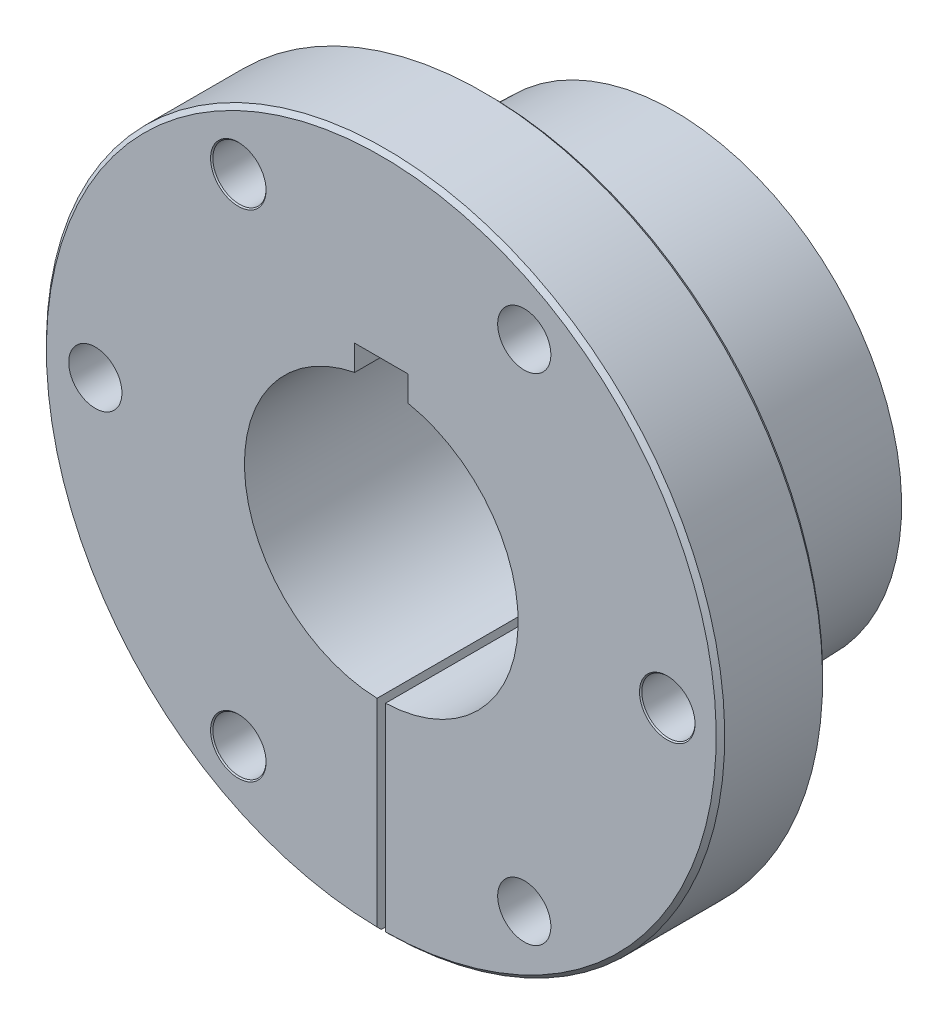
ISO-10303-21;
HEADER;
FILE_DESCRIPTION(('STEP AP214'),'2;1');
FILE_NAME('part.step','',(''),(''),'','','');
FILE_SCHEMA(('AUTOMOTIVE_DESIGN { 1 0 10303 214 1 1 1 1 }'));
ENDSEC;
DATA;
#1=APPLICATION_CONTEXT('core data for automotive mechanical design processes');
#2=APPLICATION_PROTOCOL_DEFINITION('international standard','automotive_design',2000,#1);
#3=PRODUCT_CONTEXT('',#1,'mechanical');
#4=PRODUCT('Part','Part','',(#3));
#5=PRODUCT_RELATED_PRODUCT_CATEGORY('part','',(#4));
#6=PRODUCT_DEFINITION_FORMATION('','',#4);
#7=PRODUCT_DEFINITION_CONTEXT('part definition',#1,'design');
#8=PRODUCT_DEFINITION('design','',#6,#7);
#9=PRODUCT_DEFINITION_SHAPE('','',#8);
#10=(LENGTH_UNIT() NAMED_UNIT(*) SI_UNIT(.MILLI.,.METRE.));
#11=(NAMED_UNIT(*) PLANE_ANGLE_UNIT() SI_UNIT($,.RADIAN.));
#12=(NAMED_UNIT(*) SI_UNIT($,.STERADIAN.) SOLID_ANGLE_UNIT());
#13=UNCERTAINTY_MEASURE_WITH_UNIT(LENGTH_MEASURE(1.E-05),#10,'distance_accuracy_value','');
#14=(GEOMETRIC_REPRESENTATION_CONTEXT(3) GLOBAL_UNCERTAINTY_ASSIGNED_CONTEXT((#13)) GLOBAL_UNIT_ASSIGNED_CONTEXT((#10,
#11,#12)) REPRESENTATION_CONTEXT('',''));
#15=CARTESIAN_POINT('',(0.,0.,0.));
#16=DIRECTION('',(0.,0.,1.));
#17=DIRECTION('',(1.,0.,0.));
#18=AXIS2_PLACEMENT_3D('',#15,#16,#17);
#19=CARTESIAN_POINT('',(-1.88408363451055E-13,26.98115,-12.7));
#20=DIRECTION('',(0.,0.,-1.));
#21=DIRECTION('',(-1.,0.,0.));
#22=AXIS2_PLACEMENT_3D('',#19,#20,#21);
#23=PLANE('',#22);
#24=CARTESIAN_POINT('',(-17.0656250000001,29.5585295629176,-12.7));
#25=DIRECTION('',(0.,0.,-1.));
#26=DIRECTION('',(-1.,0.,0.));
#27=AXIS2_PLACEMENT_3D('',#24,#25,#26);
#28=CIRCLE('',#27,3.31248153285078);
#29=CARTESIAN_POINT('',(-20.3781065328509,29.5585295629176,-12.7));
#30=VERTEX_POINT('',#29);
#31=EDGE_CURVE('E194',#30,#30,#28,.F.);
#32=ORIENTED_EDGE('',*,*,#31,.T.);
#33=EDGE_LOOP('',(#32));
#34=FACE_BOUND('',#33,.T.);
#35=CARTESIAN_POINT('',(17.0656249999997,29.5585295629178,-12.7));
#36=DIRECTION('',(0.,0.,-1.));
#37=DIRECTION('',(-1.,0.,0.));
#38=AXIS2_PLACEMENT_3D('',#35,#36,#37);
#39=CIRCLE('',#38,3.175);
#40=CARTESIAN_POINT('',(13.8906249999997,29.5585295629178,-12.7));
#41=VERTEX_POINT('',#40);
#42=EDGE_CURVE('E208',#41,#41,#39,.F.);
#43=ORIENTED_EDGE('',*,*,#42,.T.);
#44=EDGE_LOOP('',(#43));
#45=FACE_BOUND('',#44,.T.);
#46=CARTESIAN_POINT('',(17.0656250000001,-29.5585295629175,-12.7));
#47=DIRECTION('',(0.,0.,-1.));
#48=DIRECTION('',(-1.,0.,0.));
#49=AXIS2_PLACEMENT_3D('',#46,#47,#48);
#50=CIRCLE('',#49,3.175);
#51=CARTESIAN_POINT('',(13.8906250000001,-29.5585295629175,-12.7));
#52=VERTEX_POINT('',#51);
#53=EDGE_CURVE('E213',#52,#52,#50,.F.);
#54=ORIENTED_EDGE('',*,*,#53,.T.);
#55=EDGE_LOOP('',(#54));
#56=FACE_BOUND('',#55,.T.);
#57=DIRECTION('',(0.,1.,0.));
#58=VECTOR('',#57,1.);
#59=CARTESIAN_POINT('',(-0.508000000000005,26.98115,-12.7));
#60=LINE('',#59,#58);
#61=CARTESIAN_POINT('',(-0.508,-39.9700219109585,-12.7));
#62=VERTEX_POINT('',#61);
#63=CARTESIAN_POINT('',(-0.508000000000001,-26.9763672743848,-12.7));
#64=VERTEX_POINT('',#63);
#65=EDGE_CURVE('E311',#62,#64,#60,.T.);
#66=ORIENTED_EDGE('',*,*,#65,.F.);
#67=CARTESIAN_POINT('',(0.,0.,-12.7));
#68=DIRECTION('',(0.,0.,1.));
#69=DIRECTION('',(1.,0.,0.));
#70=AXIS2_PLACEMENT_3D('',#67,#68,#69);
#71=CIRCLE('',#70,39.97325);
#72=CARTESIAN_POINT('',(0.508,-39.9700219109585,-12.7));
#73=VERTEX_POINT('',#72);
#74=EDGE_CURVE('E369',#73,#62,#71,.T.);
#75=ORIENTED_EDGE('',*,*,#74,.F.);
#76=DIRECTION('',(0.,-1.,0.));
#77=VECTOR('',#76,1.);
#78=CARTESIAN_POINT('',(0.508000000000005,26.98115,-12.7));
#79=LINE('',#78,#77);
#80=CARTESIAN_POINT('',(0.508000000000001,-26.9763672743848,-12.7));
#81=VERTEX_POINT('',#80);
#82=EDGE_CURVE('E291',#81,#73,#79,.T.);
#83=ORIENTED_EDGE('',*,*,#82,.F.);
#84=CARTESIAN_POINT('',(0.,0.,-12.7));
#85=DIRECTION('',(0.,0.,1.));
#86=DIRECTION('',(1.,0.,0.));
#87=AXIS2_PLACEMENT_3D('',#84,#85,#86);
#88=CIRCLE('',#87,26.98115);
#89=EDGE_CURVE('E376',#81,#64,#88,.T.);
#90=ORIENTED_EDGE('',*,*,#89,.T.);
#91=EDGE_LOOP('',(#66,#75,#83,#90));
#92=FACE_BOUND('',#91,.T.);
#93=CARTESIAN_POINT('',(-34.13125,0.,-12.7));
#94=DIRECTION('',(0.,0.,-1.));
#95=DIRECTION('',(-1.,0.,0.));
#96=AXIS2_PLACEMENT_3D('',#93,#94,#95);
#97=CIRCLE('',#96,3.175);
#98=CARTESIAN_POINT('',(-37.30625,0.,-12.7));
#99=VERTEX_POINT('',#98);
#100=EDGE_CURVE('E234',#99,#99,#97,.F.);
#101=ORIENTED_EDGE('',*,*,#100,.T.);
#102=EDGE_LOOP('',(#101));
#103=FACE_BOUND('',#102,.T.);
#104=CARTESIAN_POINT('',(34.13125,0.,-12.7));
#105=DIRECTION('',(0.,0.,-1.));
#106=DIRECTION('',(-1.,0.,0.));
#107=AXIS2_PLACEMENT_3D('',#104,#105,#106);
#108=CIRCLE('',#107,3.31248153285078);
#109=CARTESIAN_POINT('',(30.8187684671492,0.,-12.7));
#110=VERTEX_POINT('',#109);
#111=EDGE_CURVE('E225',#110,#110,#108,.F.);
#112=ORIENTED_EDGE('',*,*,#111,.T.);
#113=EDGE_LOOP('',(#112));
#114=FACE_BOUND('',#113,.T.);
#115=CARTESIAN_POINT('',(-17.0656249999997,-29.5585295629178,-12.7));
#116=DIRECTION('',(0.,0.,-1.));
#117=DIRECTION('',(-1.,0.,0.));
#118=AXIS2_PLACEMENT_3D('',#115,#116,#117);
#119=CIRCLE('',#118,3.31248153285078);
#120=CARTESIAN_POINT('',(-20.3781065328505,-29.5585295629178,-12.7));
#121=VERTEX_POINT('',#120);
#122=EDGE_CURVE('E189',#121,#121,#119,.F.);
#123=ORIENTED_EDGE('',*,*,#122,.T.);
#124=EDGE_LOOP('',(#123));
#125=FACE_BOUND('',#124,.T.);
#126=ADVANCED_FACE('F40',(#34,#45,#56,#92,#103,#114,#125),#23,.T.);
#127=CARTESIAN_POINT('',(-17.0656249999997,-29.5585295629178,-34.926));
#128=DIRECTION('',(0.,0.,1.));
#129=DIRECTION('',(1.,0.,0.));
#130=AXIS2_PLACEMENT_3D('',#127,#128,#129);
#131=CYLINDRICAL_SURFACE('',#130,3.175);
#132=CARTESIAN_POINT('',(-17.0656249999997,-29.5585295629178,-0.137481532850775));
#133=DIRECTION('',(0.,0.,1.));
#134=DIRECTION('',(1.,0.,0.));
#135=AXIS2_PLACEMENT_3D('',#132,#133,#134);
#136=CIRCLE('',#135,3.175);
#137=CARTESIAN_POINT('',(-13.8906249999997,-29.5585295629178,-0.137481532850775));
#138=VERTEX_POINT('',#137);
#139=EDGE_CURVE('E198',#138,#138,#136,.T.);
#140=ORIENTED_EDGE('',*,*,#139,.T.);
#141=EDGE_LOOP('',(#140));
#142=FACE_BOUND('',#141,.T.);
#143=CARTESIAN_POINT('',(-17.0656249999997,-29.5585295629178,-12.5625184671492));
#144=DIRECTION('',(0.,0.,-1.));
#145=DIRECTION('',(-1.,0.,0.));
#146=AXIS2_PLACEMENT_3D('',#143,#144,#145);
#147=CIRCLE('',#146,3.175);
#148=CARTESIAN_POINT('',(-20.2406249999997,-29.5585295629178,-12.5625184671492));
#149=VERTEX_POINT('',#148);
#150=EDGE_CURVE('E184',#149,#149,#147,.F.);
#151=ORIENTED_EDGE('',*,*,#150,.F.);
#152=EDGE_LOOP('',(#151));
#153=FACE_BOUND('',#152,.T.);
#154=ADVANCED_FACE('F413',(#142,#153),#131,.F.);
#155=CARTESIAN_POINT('',(-17.0656250000001,29.5585295629176,-34.926));
#156=DIRECTION('',(0.,0.,1.));
#157=DIRECTION('',(1.,0.,0.));
#158=AXIS2_PLACEMENT_3D('',#155,#156,#157);
#159=CYLINDRICAL_SURFACE('',#158,3.175);
#160=CARTESIAN_POINT('',(-17.0656250000001,29.5585295629176,-0.137481532850775));
#161=DIRECTION('',(0.,0.,1.));
#162=DIRECTION('',(1.,0.,0.));
#163=AXIS2_PLACEMENT_3D('',#160,#161,#162);
#164=CIRCLE('',#163,3.175);
#165=CARTESIAN_POINT('',(-13.8906250000001,29.5585295629176,-0.137481532850775));
#166=VERTEX_POINT('',#165);
#167=EDGE_CURVE('E203',#166,#166,#164,.T.);
#168=ORIENTED_EDGE('',*,*,#167,.T.);
#169=EDGE_LOOP('',(#168));
#170=FACE_BOUND('',#169,.T.);
#171=CARTESIAN_POINT('',(-17.0656250000001,29.5585295629176,-12.5625184671492));
#172=DIRECTION('',(0.,0.,-1.));
#173=DIRECTION('',(-1.,0.,0.));
#174=AXIS2_PLACEMENT_3D('',#171,#172,#173);
#175=CIRCLE('',#174,3.175);
#176=CARTESIAN_POINT('',(-20.2406250000001,29.5585295629176,-12.5625184671492));
#177=VERTEX_POINT('',#176);
#178=EDGE_CURVE('E193',#177,#177,#175,.F.);
#179=ORIENTED_EDGE('',*,*,#178,.F.);
#180=EDGE_LOOP('',(#179));
#181=FACE_BOUND('',#180,.T.);
#182=ADVANCED_FACE('F415',(#170,#181),#159,.F.);
#183=CARTESIAN_POINT('',(34.13125,0.,-34.926));
#184=DIRECTION('',(0.,0.,1.));
#185=DIRECTION('',(1.,0.,0.));
#186=AXIS2_PLACEMENT_3D('',#183,#184,#185);
#187=CYLINDRICAL_SURFACE('',#186,3.175);
#188=CARTESIAN_POINT('',(34.13125,0.,-0.137481532850775));
#189=DIRECTION('',(0.,0.,1.));
#190=DIRECTION('',(1.,0.,0.));
#191=AXIS2_PLACEMENT_3D('',#188,#189,#190);
#192=CIRCLE('',#191,3.175);
#193=CARTESIAN_POINT('',(37.30625,0.,-0.137481532850775));
#194=VERTEX_POINT('',#193);
#195=EDGE_CURVE('E229',#194,#194,#192,.T.);
#196=ORIENTED_EDGE('',*,*,#195,.T.);
#197=EDGE_LOOP('',(#196));
#198=FACE_BOUND('',#197,.T.);
#199=CARTESIAN_POINT('',(34.13125,0.,-12.5625184671492));
#200=DIRECTION('',(0.,0.,-1.));
#201=DIRECTION('',(-1.,0.,0.));
#202=AXIS2_PLACEMENT_3D('',#199,#200,#201);
#203=CIRCLE('',#202,3.175);
#204=CARTESIAN_POINT('',(30.95625,0.,-12.5625184671492));
#205=VERTEX_POINT('',#204);
#206=EDGE_CURVE('E221',#205,#205,#203,.F.);
#207=ORIENTED_EDGE('',*,*,#206,.F.);
#208=EDGE_LOOP('',(#207));
#209=FACE_BOUND('',#208,.T.);
#210=ADVANCED_FACE('F277',(#198,#209),#187,.F.);
#211=CARTESIAN_POINT('',(-1.10854532508269E-13,15.875,-34.925));
#212=DIRECTION('',(0.,0.,-1.));
#213=DIRECTION('',(-1.,0.,0.));
#214=AXIS2_PLACEMENT_3D('',#211,#212,#213);
#215=PLANE('',#214);
#216=CARTESIAN_POINT('',(0.,0.,-34.925));
#217=DIRECTION('',(0.,0.,1.));
#218=DIRECTION('',(1.,0.,0.));
#219=AXIS2_PLACEMENT_3D('',#216,#217,#218);
#220=CIRCLE('',#219,16.3351492643292);
#221=CARTESIAN_POINT('',(0.508000000000002,-16.327248313415,-34.925));
#222=VERTEX_POINT('',#221);
#223=CARTESIAN_POINT('',(3.175,16.0236224521147,-34.925));
#224=VERTEX_POINT('',#223);
#225=EDGE_CURVE('E160',#222,#224,#220,.T.);
#226=ORIENTED_EDGE('',*,*,#225,.T.);
#227=DIRECTION('',(0.,1.,0.));
#228=VECTOR('',#227,1.);
#229=CARTESIAN_POINT('',(3.175,19.05,-34.925));
#230=LINE('',#229,#228);
#231=CARTESIAN_POINT('',(3.175,19.05,-34.925));
#232=VERTEX_POINT('',#231);
#233=EDGE_CURVE('E489',#224,#232,#230,.T.);
#234=ORIENTED_EDGE('',*,*,#233,.T.);
#235=DIRECTION('',(-1.,0.,0.));
#236=VECTOR('',#235,1.);
#237=CARTESIAN_POINT('',(-3.175,19.05,-34.925));
#238=LINE('',#237,#236);
#239=CARTESIAN_POINT('',(-3.175,19.05,-34.925));
#240=VERTEX_POINT('',#239);
#241=EDGE_CURVE('E176',#232,#240,#238,.T.);
#242=ORIENTED_EDGE('',*,*,#241,.T.);
#243=DIRECTION('',(0.,-1.,0.));
#244=VECTOR('',#243,1.);
#245=CARTESIAN_POINT('',(-3.175,19.05,-34.925));
#246=LINE('',#245,#244);
#247=CARTESIAN_POINT('',(-3.175,16.0236224521147,-34.925));
#248=VERTEX_POINT('',#247);
#249=EDGE_CURVE('E181',#240,#248,#246,.T.);
#250=ORIENTED_EDGE('',*,*,#249,.T.);
#251=CARTESIAN_POINT('',(-0.508000000000002,-16.327248313415,-34.925));
#252=VERTEX_POINT('',#251);
#253=EDGE_CURVE('E56',#248,#252,#220,.T.);
#254=ORIENTED_EDGE('',*,*,#253,.T.);
#255=DIRECTION('',(0.,-1.,0.));
#256=VECTOR('',#255,1.);
#257=CARTESIAN_POINT('',(-0.508000000000003,0.,-34.925));
#258=LINE('',#257,#256);
#259=CARTESIAN_POINT('',(-0.508000000000001,-27.1748396990701,-34.925));
#260=VERTEX_POINT('',#259);
#261=EDGE_CURVE('E242',#252,#260,#258,.T.);
#262=ORIENTED_EDGE('',*,*,#261,.T.);
#263=CARTESIAN_POINT('',(0.,0.,-34.925));
#264=DIRECTION('',(0.,0.,1.));
#265=DIRECTION('',(1.,0.,0.));
#266=AXIS2_PLACEMENT_3D('',#263,#264,#265);
#267=CIRCLE('',#266,27.1795875);
#268=CARTESIAN_POINT('',(0.508000000000001,-27.1748396990701,-34.925));
#269=VERTEX_POINT('',#268);
#270=EDGE_CURVE('E49',#269,#260,#267,.T.);
#271=ORIENTED_EDGE('',*,*,#270,.F.);
#272=DIRECTION('',(0.,1.,0.));
#273=VECTOR('',#272,1.);
#274=CARTESIAN_POINT('',(0.508000000000003,0.,-34.925));
#275=LINE('',#274,#273);
#276=EDGE_CURVE('E245',#269,#222,#275,.T.);
#277=ORIENTED_EDGE('',*,*,#276,.T.);
#278=EDGE_LOOP('',(#226,#234,#242,#250,#254,#262,#271,#277));
#279=FACE_BOUND('',#278,.T.);
#280=ADVANCED_FACE('F42',(#279),#215,.T.);
#281=CARTESIAN_POINT('',(0.,0.,-15.875));
#282=DIRECTION('',(0.,0.,1.));
#283=DIRECTION('',(1.,0.,0.));
#284=AXIS2_PLACEMENT_3D('',#281,#282,#283);
#285=CONICAL_SURFACE('',#284,27.7749,0.0312398334302683);
#286=CARTESIAN_POINT('',(-0.508000000000001,-28.9763204654552,22.7129404383794));
#287=CARTESIAN_POINT('',(-0.508000000000001,-28.4244679559789,5.05635214122596));
#288=CARTESIAN_POINT('',(-0.508000000000001,-27.8726096518357,-12.6002359748127));
#289=CARTESIAN_POINT('',(-0.508000000000001,-26.7688814542159,-47.9134118446609));
#290=CARTESIAN_POINT('',(-0.508000000000001,-26.2170115607392,-65.5699995984703));
#291=CARTESIAN_POINT('',(-0.508000000000001,-25.6651358725957,-83.226587171165));
#292=B_SPLINE_CURVE_WITH_KNOTS('',3,(#286,#287,#288,#289,#290,#291),.UNSPECIFIED.,.F.,.F.,(4,2,
4),(0.,52.9956306065473,105.991261213095),.UNSPECIFIED.);
#293=CARTESIAN_POINT('',(-0.508000000000001,-27.7702539781328,-15.875));
#294=VERTEX_POINT('',#293);
#295=EDGE_CURVE('E322',#294,#260,#292,.T.);
#296=ORIENTED_EDGE('',*,*,#295,.F.);
#297=CARTESIAN_POINT('',(0.,0.,-15.875));
#298=DIRECTION('',(0.,0.,1.));
#299=DIRECTION('',(1.,0.,0.));
#300=AXIS2_PLACEMENT_3D('',#297,#298,#299);
#301=CIRCLE('',#300,27.7749);
#302=CARTESIAN_POINT('',(0.508000000000001,-27.7702539781328,-15.875));
#303=VERTEX_POINT('',#302);
#304=EDGE_CURVE('E386',#303,#294,#301,.T.);
#305=ORIENTED_EDGE('',*,*,#304,.F.);
#306=CARTESIAN_POINT('',(0.508000000000001,-25.6651358725957,-83.226587171165));
#307=CARTESIAN_POINT('',(0.508000000000001,-26.2170115607392,-65.5699995984703));
#308=CARTESIAN_POINT('',(0.508000000000001,-26.7688814542159,-47.9134118446609));
#309=CARTESIAN_POINT('',(0.508000000000001,-27.8726096518357,-12.6002359748127));
#310=CARTESIAN_POINT('',(0.508000000000001,-28.4244679559789,5.05635214122596));
#311=CARTESIAN_POINT('',(0.508000000000001,-28.9763204654552,22.7129404383794));
#312=B_SPLINE_CURVE_WITH_KNOTS('',3,(#306,#307,#308,#309,#310,#311),.UNSPECIFIED.,.F.,.F.,(4,2,
4),(0.,52.995630606548,105.991261213095),.UNSPECIFIED.);
#313=EDGE_CURVE('E339',#269,#303,#312,.T.);
#314=ORIENTED_EDGE('',*,*,#313,.F.);
#315=ORIENTED_EDGE('',*,*,#270,.T.);
#316=EDGE_LOOP('',(#296,#305,#314,#315));
#317=FACE_BOUND('',#316,.T.);
#318=ADVANCED_FACE('F332',(#317),#285,.T.);
#319=CARTESIAN_POINT('',(-1.93951090076468E-13,27.7749,-15.875));
#320=DIRECTION('',(0.,0.,1.));
#321=DIRECTION('',(1.,0.,0.));
#322=AXIS2_PLACEMENT_3D('',#319,#320,#321);
#323=PLANE('',#322);
#324=DIRECTION('',(0.,-1.,0.));
#325=VECTOR('',#324,1.);
#326=CARTESIAN_POINT('',(-0.508000000000005,27.7749,-15.875));
#327=LINE('',#326,#325);
#328=CARTESIAN_POINT('',(-0.508000000000001,-26.9763672743848,-15.875));
#329=VERTEX_POINT('',#328);
#330=EDGE_CURVE('E319',#329,#294,#327,.T.);
#331=ORIENTED_EDGE('',*,*,#330,.F.);
#332=CARTESIAN_POINT('',(0.,0.,-15.875));
#333=DIRECTION('',(0.,0.,1.));
#334=DIRECTION('',(1.,0.,0.));
#335=AXIS2_PLACEMENT_3D('',#332,#333,#334);
#336=CIRCLE('',#335,26.98115);
#337=CARTESIAN_POINT('',(0.508000000000001,-26.9763672743848,-15.875));
#338=VERTEX_POINT('',#337);
#339=EDGE_CURVE('E382',#338,#329,#336,.T.);
#340=ORIENTED_EDGE('',*,*,#339,.F.);
#341=DIRECTION('',(0.,1.,0.));
#342=VECTOR('',#341,1.);
#343=CARTESIAN_POINT('',(0.508000000000005,27.7749,-15.875));
#344=LINE('',#343,#342);
#345=EDGE_CURVE('E347',#303,#338,#344,.T.);
#346=ORIENTED_EDGE('',*,*,#345,.F.);
#347=ORIENTED_EDGE('',*,*,#304,.T.);
#348=EDGE_LOOP('',(#331,#340,#346,#347));
#349=FACE_BOUND('',#348,.T.);
#350=ADVANCED_FACE('F336',(#349),#323,.T.);
#351=CARTESIAN_POINT('',(0.,0.,0.));
#352=DIRECTION('',(0.,0.,1.));
#353=DIRECTION('',(1.,0.,0.));
#354=AXIS2_PLACEMENT_3D('',#351,#352,#353);
#355=CYLINDRICAL_SURFACE('',#354,26.98115);
#356=DIRECTION('',(0.,0.,1.));
#357=VECTOR('',#356,1.);
#358=CARTESIAN_POINT('',(-0.508000000000001,-26.9763672743848,0.));
#359=LINE('',#358,#357);
#360=EDGE_CURVE('E316',#64,#329,#359,.F.);
#361=ORIENTED_EDGE('',*,*,#360,.F.);
#362=ORIENTED_EDGE('',*,*,#89,.F.);
#363=DIRECTION('',(0.,0.,1.));
#364=VECTOR('',#363,1.);
#365=CARTESIAN_POINT('',(0.508000000000001,-26.9763672743848,0.));
#366=LINE('',#365,#364);
#367=EDGE_CURVE('E468',#338,#81,#366,.T.);
#368=ORIENTED_EDGE('',*,*,#367,.F.);
#369=ORIENTED_EDGE('',*,*,#339,.T.);
#370=EDGE_LOOP('',(#361,#362,#368,#369));
#371=FACE_BOUND('',#370,.T.);
#372=ADVANCED_FACE('F298',(#371),#355,.T.);
#373=CARTESIAN_POINT('',(0.,0.,-12.192));
#374=DIRECTION('',(0.,0.,1.));
#375=DIRECTION('',(1.,0.,0.));
#376=AXIS2_PLACEMENT_3D('',#373,#374,#375);
#377=CONICAL_SURFACE('',#376,40.48125,0.785398163397457);
#378=CARTESIAN_POINT('',(-0.507999999999998,-69.1589964893393,16.4876121939633));
#379=CARTESIAN_POINT('',(-0.507999999999998,-66.5476374563169,13.8763243733235));
#380=CARTESIAN_POINT('',(-0.507999999999998,-63.9362751585272,11.2650398175094));
#381=CARTESIAN_POINT('',(-0.507999999999999,-58.713538942019,6.0424823542008));
#382=CARTESIAN_POINT('',(-0.507999999999999,-56.1021650233004,3.43120944670634));
#383=CARTESIAN_POINT('',(-0.507999999999999,-50.8794004839596,-1.79131959087549));
#384=CARTESIAN_POINT('',(-0.507999999999999,-48.2680098633376,-4.40257572096311));
#385=CARTESIAN_POINT('',(-0.508,-43.0452014626395,-9.62506084621428));
#386=CARTESIAN_POINT('',(-0.508,-40.4337836825632,-12.2362898413777));
#387=CARTESIAN_POINT('',(-0.508,-35.210901936381,-17.4587017903888));
#388=CARTESIAN_POINT('',(-0.508000000000001,-32.5994379702737,-20.0698847442351));
#389=CARTESIAN_POINT('',(-0.508000000000001,-28.6821714033987,-23.9865885049184));
#390=CARTESIAN_POINT('',(-0.508000000000001,-27.3764041221107,-25.2921446361781));
#391=CARTESIAN_POINT('',(-0.508000000000001,-24.7648330886872,-27.9032204397117));
#392=CARTESIAN_POINT('',(-0.508000000000001,-23.4590293365515,-29.2087401119853));
#393=CARTESIAN_POINT('',(-0.508000000000002,-20.8473626358335,-31.819720382612));
#394=CARTESIAN_POINT('',(-0.508000000000002,-19.5414996872482,-33.1251809809618));
#395=CARTESIAN_POINT('',(-0.508000000000002,-16.9296710533228,-35.7359993522473));
#396=CARTESIAN_POINT('',(-0.508000000000002,-15.6237053679849,-37.0413571251851));
#397=CARTESIAN_POINT('',(-0.508000000000002,-13.664596442021,-38.9992334067168));
#398=CARTESIAN_POINT('',(-0.508000000000002,-13.0115333720803,-39.6518321325144));
#399=CARTESIAN_POINT('',(-0.508000000000002,-11.7053197190082,-40.9569419670216));
#400=CARTESIAN_POINT('',(-0.508000000000002,-11.0521691358785,-41.609453075733));
#401=CARTESIAN_POINT('',(-0.508000000000002,-9.74573445737477,-42.9143417716375));
#402=CARTESIAN_POINT('',(-0.508000000000002,-9.09245036198895,-43.566719358819));
#403=CARTESIAN_POINT('',(-0.508000000000002,-7.7855930878027,-44.8711849959762));
#404=CARTESIAN_POINT('',(-0.508000000000002,-7.13201990898033,-45.52327304593));
#405=CARTESIAN_POINT('',(-0.508000000000003,-6.47822442383138,-46.1751382984722));
#406=B_SPLINE_CURVE_WITH_KNOTS('',3,(#378,#379,#380,#381,#382,#383,#384,#385,#386,#387,#388,
#389,#390,#391,#392,#393,#394,#395,#396,#397,#398,#399,#400,#401,#402,#403,#404,#405),
.UNSPECIFIED.,.F.,.F.,(4,2,2,2,2,2,2,2,2,2,2,2,2,4),(0.,11.0789070189571,22.1578139806704,
33.2367207836906,44.3156276423277,55.3945348153457,60.9339883117279,66.4734418470067,
72.0128956744212,77.552349387445,80.3220764839178,83.0918035246127,85.8615308081327,
88.6312583020137),.UNSPECIFIED.);
#407=CARTESIAN_POINT('',(-0.508,-40.4780624235215,-12.192));
#408=VERTEX_POINT('',#407);
#409=EDGE_CURVE('E303',#408,#62,#406,.T.);
#410=ORIENTED_EDGE('',*,*,#409,.F.);
#411=CARTESIAN_POINT('',(0.,0.,-12.192));
#412=DIRECTION('',(0.,0.,1.));
#413=DIRECTION('',(1.,0.,0.));
#414=AXIS2_PLACEMENT_3D('',#411,#412,#413);
#415=CIRCLE('',#414,40.48125);
#416=CARTESIAN_POINT('',(0.508,-40.4780624235215,-12.192));
#417=VERTEX_POINT('',#416);
#418=EDGE_CURVE('E367',#417,#408,#415,.T.);
#419=ORIENTED_EDGE('',*,*,#418,.F.);
#420=CARTESIAN_POINT('',(0.508000000000003,-6.47822442383138,-46.1751382984722));
#421=CARTESIAN_POINT('',(0.508000000000003,-6.92750194215529,-45.7272144717513));
#422=CARTESIAN_POINT('',(0.508000000000002,-7.376660190333,-45.2791710794303));
#423=CARTESIAN_POINT('',(0.508000000000002,-8.27480988366716,-44.3829171854311));
#424=CARTESIAN_POINT('',(0.508000000000002,-8.7238013288339,-43.9347066837631));
#425=CARTESIAN_POINT('',(0.508000000000002,-10.0706330824567,-42.5899325308355));
#426=CARTESIAN_POINT('',(0.508000000000002,-10.9683308754569,-41.6932261653886));
#427=CARTESIAN_POINT('',(0.508000000000002,-13.661172498799,-39.0028559196428));
#428=CARTESIAN_POINT('',(0.508000000000002,-15.4560649764089,-37.2089404876826));
#429=CARTESIAN_POINT('',(0.508000000000002,-19.0456393306199,-33.6208989541218));
#430=CARTESIAN_POINT('',(0.508000000000001,-20.8403212072201,-31.8267728525203));
#431=CARTESIAN_POINT('',(0.508000000000001,-26.2242176328872,-26.4442447086495));
#432=CARTESIAN_POINT('',(0.508000000000001,-29.8132826809762,-22.8556931240166));
#433=CARTESIAN_POINT('',(0.508,-34.1389756962338,-18.5304960133028));
#434=CARTESIAN_POINT('',(0.508,-34.8756525229658,-17.7938993427032));
#435=CARTESIAN_POINT('',(0.508,-36.3490010821156,-16.3207009412015));
#436=CARTESIAN_POINT('',(0.508,-37.0856728145334,-15.5840992102995));
#437=CARTESIAN_POINT('',(0.508,-43.0452254662174,-9.62508534711366));
#438=CARTESIAN_POINT('',(0.508,-48.2680226121946,-4.40258943486921));
#439=CARTESIAN_POINT('',(0.507999999999998,-58.7135419950761,6.04247839075119));
#440=CARTESIAN_POINT('',(0.507999999999998,-63.9362642319725,11.265050304135));
#441=CARTESIAN_POINT('',(0.507999999999998,-69.1589964893393,16.4876121939633));
#442=B_SPLINE_CURVE_WITH_KNOTS('',3,(#420,#421,#422,#423,#424,#425,#426,#427,#428,#429,#430,
#431,#432,#433,#434,#435,#436,#437,#438,#439,#440,#441),.UNSPECIFIED.,.F.,.F.,(4,2,2,2,2,2,2,2,
2,2,4),(0.,1.90325354440624,3.80650697137256,7.61301354383694,15.2260249807147,22.8390364484862,
38.0650606431331,41.1903456896331,44.3156306624196,66.4734433290347,88.6312583043606),.UNSPECIFIED.);
#443=EDGE_CURVE('E283',#73,#417,#442,.T.);
#444=ORIENTED_EDGE('',*,*,#443,.F.);
#445=ORIENTED_EDGE('',*,*,#74,.T.);
#446=EDGE_LOOP('',(#410,#419,#444,#445));
#447=FACE_BOUND('',#446,.T.);
#448=ADVANCED_FACE('F293',(#447),#377,.T.);
#449=CARTESIAN_POINT('',(0.,0.,0.));
#450=DIRECTION('',(0.,0.,1.));
#451=DIRECTION('',(1.,0.,0.));
#452=AXIS2_PLACEMENT_3D('',#449,#450,#451);
#453=CYLINDRICAL_SURFACE('',#452,40.48125);
#454=DIRECTION('',(0.,0.,1.));
#455=VECTOR('',#454,1.);
#456=CARTESIAN_POINT('',(-0.508,-40.4780624235215,0.));
#457=LINE('',#456,#455);
#458=CARTESIAN_POINT('',(-0.508,-40.4780624235215,-0.508000000000009));
#459=VERTEX_POINT('',#458);
#460=EDGE_CURVE('E312',#459,#408,#457,.F.);
#461=ORIENTED_EDGE('',*,*,#460,.F.);
#462=CARTESIAN_POINT('',(0.,0.,-0.508000000000009));
#463=DIRECTION('',(0.,0.,1.));
#464=DIRECTION('',(1.,0.,0.));
#465=AXIS2_PLACEMENT_3D('',#462,#463,#464);
#466=CIRCLE('',#465,40.48125);
#467=CARTESIAN_POINT('',(0.508,-40.4780624235215,-0.508000000000009));
#468=VERTEX_POINT('',#467);
#469=EDGE_CURVE('E372',#468,#459,#466,.T.);
#470=ORIENTED_EDGE('',*,*,#469,.F.);
#471=DIRECTION('',(0.,0.,1.));
#472=VECTOR('',#471,1.);
#473=CARTESIAN_POINT('',(0.508,-40.4780624235215,0.));
#474=LINE('',#473,#472);
#475=EDGE_CURVE('E264',#417,#468,#474,.T.);
#476=ORIENTED_EDGE('',*,*,#475,.F.);
#477=ORIENTED_EDGE('',*,*,#418,.T.);
#478=EDGE_LOOP('',(#461,#470,#476,#477));
#479=FACE_BOUND('',#478,.T.);
#480=ADVANCED_FACE('F297',(#479),#453,.T.);
#481=CARTESIAN_POINT('',(0.,0.,0.));
#482=DIRECTION('',(0.,0.,-1.));
#483=DIRECTION('',(-1.,0.,0.));
#484=AXIS2_PLACEMENT_3D('',#481,#482,#483);
#485=CONICAL_SURFACE('',#484,39.97325,0.785398163397443);
#486=CARTESIAN_POINT('',(-0.508000000000003,-6.47822442383165,33.4751382984728));
#487=CARTESIAN_POINT('',(-0.508000000000003,-6.92750194215557,33.027214471752));
#488=CARTESIAN_POINT('',(-0.508000000000002,-7.37666019033329,32.579171079431));
#489=CARTESIAN_POINT('',(-0.508000000000002,-8.27480988366748,31.6829171854316));
#490=CARTESIAN_POINT('',(-0.508000000000002,-8.72380132883424,31.2347066837636));
#491=CARTESIAN_POINT('',(-0.508000000000002,-10.0706330824571,29.889932530836));
#492=CARTESIAN_POINT('',(-0.508000000000002,-10.9683308754574,28.993226165389));
#493=CARTESIAN_POINT('',(-0.508000000000002,-13.6611724987995,26.302855919643));
#494=CARTESIAN_POINT('',(-0.508000000000002,-15.4560649764095,24.5089404876827));
#495=CARTESIAN_POINT('',(-0.508000000000002,-19.0456393306206,20.9208989541217));
#496=CARTESIAN_POINT('',(-0.508000000000001,-20.8403212072209,19.1267728525201));
#497=CARTESIAN_POINT('',(-0.508000000000001,-26.2242176328881,13.744244708649));
#498=CARTESIAN_POINT('',(-0.508000000000001,-29.8132826809772,10.1556931240158));
#499=CARTESIAN_POINT('',(-0.508,-34.1389756962348,5.83049601330196));
#500=CARTESIAN_POINT('',(-0.508,-34.8756525229666,5.09389934270255));
#501=CARTESIAN_POINT('',(-0.508,-36.349001082116,3.62070094120116));
#502=CARTESIAN_POINT('',(-0.508,-37.0856728145336,2.8840992102993));
#503=CARTESIAN_POINT('',(-0.508,-43.0452254662174,-3.07491465288646));
#504=CARTESIAN_POINT('',(-0.508,-48.2680226121946,-8.29741056513103));
#505=CARTESIAN_POINT('',(-0.507999999999998,-58.713541995076,-18.7424783907516));
#506=CARTESIAN_POINT('',(-0.507999999999998,-63.9362642319724,-23.9650503041356));
#507=CARTESIAN_POINT('',(-0.507999999999998,-69.1589964893392,-29.187612193964));
#508=B_SPLINE_CURVE_WITH_KNOTS('',3,(#486,#487,#488,#489,#490,#491,#492,#493,#494,#495,#496,
#497,#498,#499,#500,#501,#502,#503,#504,#505,#506,#507),.UNSPECIFIED.,.F.,.F.,(4,2,2,2,2,2,2,2,
2,2,4),(0.,1.90325354440633,3.80650697137274,7.6130135438373,15.2260249807154,22.8390364484873,
38.0650606431349,41.1903456896342,44.3156306624199,66.4734433290352,88.6312583043613),.UNSPECIFIED.);
#509=CARTESIAN_POINT('',(-0.508,-39.9700219109585,0.));
#510=VERTEX_POINT('',#509);
#511=EDGE_CURVE('E346',#510,#459,#508,.T.);
#512=ORIENTED_EDGE('',*,*,#511,.F.);
#513=CARTESIAN_POINT('',(0.,0.,0.));
#514=DIRECTION('',(0.,0.,1.));
#515=DIRECTION('',(1.,0.,0.));
#516=AXIS2_PLACEMENT_3D('',#513,#514,#515);
#517=CIRCLE('',#516,39.97325);
#518=CARTESIAN_POINT('',(0.508,-39.9700219109585,0.));
#519=VERTEX_POINT('',#518);
#520=EDGE_CURVE('E330',#519,#510,#517,.T.);
#521=ORIENTED_EDGE('',*,*,#520,.F.);
#522=CARTESIAN_POINT('',(0.507999999999998,-69.1589964893392,-29.187612193964));
#523=CARTESIAN_POINT('',(0.507999999999998,-66.5476374563168,-26.5763243733242));
#524=CARTESIAN_POINT('',(0.507999999999998,-63.9362751585272,-23.9650398175099));
#525=CARTESIAN_POINT('',(0.507999999999999,-58.7135389420189,-18.7424823542013));
#526=CARTESIAN_POINT('',(0.507999999999999,-56.1021650233004,-16.1312094467068));
#527=CARTESIAN_POINT('',(0.507999999999999,-50.8794004839596,-10.9086804091248));
#528=CARTESIAN_POINT('',(0.507999999999999,-48.2680098633376,-8.29742427903713));
#529=CARTESIAN_POINT('',(0.508,-43.0452014626395,-3.07493915378584));
#530=CARTESIAN_POINT('',(0.508,-40.4337836825632,-0.463710158622371));
#531=CARTESIAN_POINT('',(0.508,-35.210901936381,4.75870179038883));
#532=CARTESIAN_POINT('',(0.508000000000001,-32.5994379702738,7.36988474423525));
#533=CARTESIAN_POINT('',(0.508000000000001,-28.6821714033988,11.2865885049186));
#534=CARTESIAN_POINT('',(0.508000000000001,-27.3764041221109,12.5921446361783));
#535=CARTESIAN_POINT('',(0.508000000000001,-24.7648330886874,15.2032204397119));
#536=CARTESIAN_POINT('',(0.508000000000001,-23.4590293365516,16.5087401119856));
#537=CARTESIAN_POINT('',(0.508000000000002,-20.8473626358337,19.1197203826123));
#538=CARTESIAN_POINT('',(0.508000000000002,-19.5414996872484,20.4251809809622));
#539=CARTESIAN_POINT('',(0.508000000000002,-16.929671053323,23.0359993522477));
#540=CARTESIAN_POINT('',(0.508000000000002,-15.6237053679851,24.3413571251855));
#541=CARTESIAN_POINT('',(0.508000000000002,-13.6645964420212,26.2992334067173));
#542=CARTESIAN_POINT('',(0.508000000000002,-13.0115333720805,26.9518321325149));
#543=CARTESIAN_POINT('',(0.508000000000002,-11.7053197190084,28.2569419670221));
#544=CARTESIAN_POINT('',(0.508000000000002,-11.0521691358788,28.9094530757335));
#545=CARTESIAN_POINT('',(0.508000000000002,-9.74573445737503,30.2143417716381));
#546=CARTESIAN_POINT('',(0.508000000000002,-9.09245036198921,30.8667193588196));
#547=CARTESIAN_POINT('',(0.508000000000002,-7.78559308780297,32.1711849959769));
#548=CARTESIAN_POINT('',(0.508000000000002,-7.13201990898059,32.8232730459306));
#549=CARTESIAN_POINT('',(0.508000000000003,-6.47822442383165,33.4751382984728));
#550=B_SPLINE_CURVE_WITH_KNOTS('',3,(#522,#523,#524,#525,#526,#527,#528,#529,#530,#531,#532,
#533,#534,#535,#536,#537,#538,#539,#540,#541,#542,#543,#544,#545,#546,#547,#548,#549),
.UNSPECIFIED.,.F.,.F.,(4,2,2,2,2,2,2,2,2,2,2,2,2,4),(0.,11.0789070189571,22.1578139806705,
33.2367207836908,44.315627642328,55.3945348153462,60.9339883117284,66.4734418470072,
72.0128956744218,77.5523493874456,80.3220764839185,83.0918035246133,85.8615308081334,
88.6312583020145),.UNSPECIFIED.);
#551=EDGE_CURVE('E250',#468,#519,#550,.T.);
#552=ORIENTED_EDGE('',*,*,#551,.F.);
#553=ORIENTED_EDGE('',*,*,#469,.T.);
#554=EDGE_LOOP('',(#512,#521,#552,#553));
#555=FACE_BOUND('',#554,.T.);
#556=ADVANCED_FACE('F266',(#555),#485,.T.);
#557=CARTESIAN_POINT('',(-1.1085453250827E-13,15.875,0.));
#558=DIRECTION('',(0.,0.,1.));
#559=DIRECTION('',(1.,0.,0.));
#560=AXIS2_PLACEMENT_3D('',#557,#558,#559);
#561=PLANE('',#560);
#562=CARTESIAN_POINT('',(0.,0.,0.));
#563=DIRECTION('',(0.,0.,1.));
#564=DIRECTION('',(1.,0.,0.));
#565=AXIS2_PLACEMENT_3D('',#562,#563,#564);
#566=CIRCLE('',#565,16.3351492643292);
#567=CARTESIAN_POINT('',(-3.175,16.0236224521147,0.));
#568=VERTEX_POINT('',#567);
#569=CARTESIAN_POINT('',(-0.508000000000002,-16.327248313415,0.));
#570=VERTEX_POINT('',#569);
#571=EDGE_CURVE('E141',#568,#570,#566,.T.);
#572=ORIENTED_EDGE('',*,*,#571,.F.);
#573=DIRECTION('',(0.,-1.,0.));
#574=VECTOR('',#573,1.);
#575=CARTESIAN_POINT('',(-3.175,19.05,0.));
#576=LINE('',#575,#574);
#577=CARTESIAN_POINT('',(-3.175,19.05,0.));
#578=VERTEX_POINT('',#577);
#579=EDGE_CURVE('E156',#578,#568,#576,.T.);
#580=ORIENTED_EDGE('',*,*,#579,.F.);
#581=DIRECTION('',(-1.,0.,0.));
#582=VECTOR('',#581,1.);
#583=CARTESIAN_POINT('',(-3.175,19.05,0.));
#584=LINE('',#583,#582);
#585=CARTESIAN_POINT('',(3.175,19.05,0.));
#586=VERTEX_POINT('',#585);
#587=EDGE_CURVE('E171',#586,#578,#584,.T.);
#588=ORIENTED_EDGE('',*,*,#587,.F.);
#589=DIRECTION('',(0.,1.,0.));
#590=VECTOR('',#589,1.);
#591=CARTESIAN_POINT('',(3.175,19.05,0.));
#592=LINE('',#591,#590);
#593=CARTESIAN_POINT('',(3.175,16.0236224521147,0.));
#594=VERTEX_POINT('',#593);
#595=EDGE_CURVE('E166',#594,#586,#592,.T.);
#596=ORIENTED_EDGE('',*,*,#595,.F.);
#597=CARTESIAN_POINT('',(0.508000000000002,-16.327248313415,0.));
#598=VERTEX_POINT('',#597);
#599=EDGE_CURVE('E64',#598,#594,#566,.T.);
#600=ORIENTED_EDGE('',*,*,#599,.F.);
#601=DIRECTION('',(0.,1.,0.));
#602=VECTOR('',#601,1.);
#603=CARTESIAN_POINT('',(0.508000000000003,0.,0.));
#604=LINE('',#603,#602);
#605=EDGE_CURVE('E246',#519,#598,#604,.T.);
#606=ORIENTED_EDGE('',*,*,#605,.F.);
#607=ORIENTED_EDGE('',*,*,#520,.T.);
#608=DIRECTION('',(0.,-1.,0.));
#609=VECTOR('',#608,1.);
#610=CARTESIAN_POINT('',(-0.508000000000003,0.,0.));
#611=LINE('',#610,#609);
#612=EDGE_CURVE('E158',#570,#510,#611,.T.);
#613=ORIENTED_EDGE('',*,*,#612,.F.);
#614=EDGE_LOOP('',(#572,#580,#588,#596,#600,#606,#607,#613));
#615=FACE_BOUND('',#614,.T.);
#616=CARTESIAN_POINT('',(-17.0656249999997,-29.5585295629178,0.));
#617=DIRECTION('',(0.,0.,1.));
#618=DIRECTION('',(1.,0.,0.));
#619=AXIS2_PLACEMENT_3D('',#616,#617,#618);
#620=CIRCLE('',#619,3.31248153285077);
#621=CARTESIAN_POINT('',(-13.753143467149,-29.5585295629178,0.));
#622=VERTEX_POINT('',#621);
#623=EDGE_CURVE('E199',#622,#622,#620,.T.);
#624=ORIENTED_EDGE('',*,*,#623,.F.);
#625=EDGE_LOOP('',(#624));
#626=FACE_BOUND('',#625,.T.);
#627=CARTESIAN_POINT('',(-17.0656250000001,29.5585295629176,0.));
#628=DIRECTION('',(0.,0.,1.));
#629=DIRECTION('',(1.,0.,0.));
#630=AXIS2_PLACEMENT_3D('',#627,#628,#629);
#631=CIRCLE('',#630,3.31248153285077);
#632=CARTESIAN_POINT('',(-13.7531434671494,29.5585295629176,0.));
#633=VERTEX_POINT('',#632);
#634=EDGE_CURVE('E204',#633,#633,#631,.T.);
#635=ORIENTED_EDGE('',*,*,#634,.F.);
#636=EDGE_LOOP('',(#635));
#637=FACE_BOUND('',#636,.T.);
#638=CARTESIAN_POINT('',(17.0656249999997,29.5585295629178,0.));
#639=DIRECTION('',(0.,0.,1.));
#640=DIRECTION('',(-0.499999999999992,-0.866025403784443,0.));
#641=AXIS2_PLACEMENT_3D('',#638,#639,#640);
#642=CIRCLE('',#641,3.175);
#643=CARTESIAN_POINT('',(15.4781249999997,26.8088989059022,0.));
#644=VERTEX_POINT('',#643);
#645=EDGE_CURVE('E209',#644,#644,#642,.T.);
#646=ORIENTED_EDGE('',*,*,#645,.F.);
#647=EDGE_LOOP('',(#646));
#648=FACE_BOUND('',#647,.T.);
#649=CARTESIAN_POINT('',(17.0656250000001,-29.5585295629175,0.));
#650=DIRECTION('',(0.,0.,1.));
#651=DIRECTION('',(-0.500000000000004,0.866025403784436,0.));
#652=AXIS2_PLACEMENT_3D('',#649,#650,#651);
#653=CIRCLE('',#652,3.175);
#654=CARTESIAN_POINT('',(15.4781250000001,-26.808898905902,0.));
#655=VERTEX_POINT('',#654);
#656=EDGE_CURVE('E217',#655,#655,#653,.T.);
#657=ORIENTED_EDGE('',*,*,#656,.F.);
#658=EDGE_LOOP('',(#657));
#659=FACE_BOUND('',#658,.T.);
#660=CARTESIAN_POINT('',(34.13125,0.,0.));
#661=DIRECTION('',(0.,0.,1.));
#662=DIRECTION('',(1.,0.,0.));
#663=AXIS2_PLACEMENT_3D('',#660,#661,#662);
#664=CIRCLE('',#663,3.31248153285077);
#665=CARTESIAN_POINT('',(37.4437315328508,0.,0.));
#666=VERTEX_POINT('',#665);
#667=EDGE_CURVE('E230',#666,#666,#664,.T.);
#668=ORIENTED_EDGE('',*,*,#667,.F.);
#669=EDGE_LOOP('',(#668));
#670=FACE_BOUND('',#669,.T.);
#671=CARTESIAN_POINT('',(-34.13125,0.,0.));
#672=DIRECTION('',(0.,0.,1.));
#673=DIRECTION('',(1.,0.,0.));
#674=AXIS2_PLACEMENT_3D('',#671,#672,#673);
#675=CIRCLE('',#674,3.175);
#676=CARTESIAN_POINT('',(-30.95625,0.,0.));
#677=VERTEX_POINT('',#676);
#678=EDGE_CURVE('E235',#677,#677,#675,.T.);
#679=ORIENTED_EDGE('',*,*,#678,.F.);
#680=EDGE_LOOP('',(#679));
#681=FACE_BOUND('',#680,.T.);
#682=ADVANCED_FACE('F153',(#615,#626,#637,#648,#659,#670,#681),#561,.T.);
#683=CARTESIAN_POINT('',(0.508000000000003,0.,-34.925));
#684=DIRECTION('',(1.,0.,0.));
#685=DIRECTION('',(0.,1.,0.));
#686=AXIS2_PLACEMENT_3D('',#683,#684,#685);
#687=PLANE('',#686);
#688=ORIENTED_EDGE('',*,*,#605,.T.);
#689=DIRECTION('',(0.,0.,1.));
#690=VECTOR('',#689,1.);
#691=CARTESIAN_POINT('',(0.508000000000002,-16.327248313415,-34.925));
#692=LINE('',#691,#690);
#693=EDGE_CURVE('E167',#598,#222,#692,.F.);
#694=ORIENTED_EDGE('',*,*,#693,.T.);
#695=ORIENTED_EDGE('',*,*,#276,.F.);
#696=ORIENTED_EDGE('',*,*,#313,.T.);
#697=ORIENTED_EDGE('',*,*,#345,.T.);
#698=ORIENTED_EDGE('',*,*,#367,.T.);
#699=ORIENTED_EDGE('',*,*,#82,.T.);
#700=ORIENTED_EDGE('',*,*,#443,.T.);
#701=ORIENTED_EDGE('',*,*,#475,.T.);
#702=ORIENTED_EDGE('',*,*,#551,.T.);
#703=EDGE_LOOP('',(#688,#694,#695,#696,#697,#698,#699,#700,#701,#702));
#704=FACE_BOUND('',#703,.T.);
#705=ADVANCED_FACE('F270',(#704),#687,.F.);
#706=CARTESIAN_POINT('',(-0.508000000000003,0.,-34.925));
#707=DIRECTION('',(-1.,0.,0.));
#708=DIRECTION('',(0.,-1.,0.));
#709=AXIS2_PLACEMENT_3D('',#706,#707,#708);
#710=PLANE('',#709);
#711=ORIENTED_EDGE('',*,*,#261,.F.);
#712=DIRECTION('',(0.,0.,1.));
#713=VECTOR('',#712,1.);
#714=CARTESIAN_POINT('',(-0.508000000000002,-16.327248313415,-34.925));
#715=LINE('',#714,#713);
#716=EDGE_CURVE('E148',#252,#570,#715,.T.);
#717=ORIENTED_EDGE('',*,*,#716,.T.);
#718=ORIENTED_EDGE('',*,*,#612,.T.);
#719=ORIENTED_EDGE('',*,*,#511,.T.);
#720=ORIENTED_EDGE('',*,*,#460,.T.);
#721=ORIENTED_EDGE('',*,*,#409,.T.);
#722=ORIENTED_EDGE('',*,*,#65,.T.);
#723=ORIENTED_EDGE('',*,*,#360,.T.);
#724=ORIENTED_EDGE('',*,*,#330,.T.);
#725=ORIENTED_EDGE('',*,*,#295,.T.);
#726=EDGE_LOOP('',(#711,#717,#718,#719,#720,#721,#722,#723,#724,#725));
#727=FACE_BOUND('',#726,.T.);
#728=ADVANCED_FACE('F275',(#727),#710,.F.);
#729=CARTESIAN_POINT('',(-34.13125,0.,-34.926));
#730=DIRECTION('',(0.,0.,1.));
#731=DIRECTION('',(1.,0.,0.));
#732=AXIS2_PLACEMENT_3D('',#729,#730,#731);
#733=CYLINDRICAL_SURFACE('',#732,3.175);
#734=ORIENTED_EDGE('',*,*,#100,.F.);
#735=EDGE_LOOP('',(#734));
#736=FACE_BOUND('',#735,.T.);
#737=ORIENTED_EDGE('',*,*,#678,.T.);
#738=EDGE_LOOP('',(#737));
#739=FACE_BOUND('',#738,.T.);
#740=ADVANCED_FACE('F439',(#736,#739),#733,.F.);
#741=CARTESIAN_POINT('',(34.13125,0.,0.));
#742=DIRECTION('',(0.,0.,1.));
#743=DIRECTION('',(1.,0.,0.));
#744=AXIS2_PLACEMENT_3D('',#741,#742,#743);
#745=CONICAL_SURFACE('',#744,3.31248153285077,0.78539816339745);
#746=ORIENTED_EDGE('',*,*,#667,.T.);
#747=EDGE_LOOP('',(#746));
#748=FACE_BOUND('',#747,.T.);
#749=ORIENTED_EDGE('',*,*,#195,.F.);
#750=EDGE_LOOP('',(#749));
#751=FACE_BOUND('',#750,.T.);
#752=ADVANCED_FACE('F436',(#748,#751),#745,.F.);
#753=CARTESIAN_POINT('',(34.13125,0.,-12.7));
#754=DIRECTION('',(0.,0.,-1.));
#755=DIRECTION('',(-1.,0.,0.));
#756=AXIS2_PLACEMENT_3D('',#753,#754,#755);
#757=CONICAL_SURFACE('',#756,3.31248153285078,0.78539816339745);
#758=ORIENTED_EDGE('',*,*,#111,.F.);
#759=EDGE_LOOP('',(#758));
#760=FACE_BOUND('',#759,.T.);
#761=ORIENTED_EDGE('',*,*,#206,.T.);
#762=EDGE_LOOP('',(#761));
#763=FACE_BOUND('',#762,.T.);
#764=ADVANCED_FACE('F431',(#760,#763),#757,.F.);
#765=CARTESIAN_POINT('',(17.0656250000001,-29.5585295629175,-34.926));
#766=DIRECTION('',(0.,0.,1.));
#767=DIRECTION('',(1.,0.,0.));
#768=AXIS2_PLACEMENT_3D('',#765,#766,#767);
#769=CYLINDRICAL_SURFACE('',#768,3.175);
#770=ORIENTED_EDGE('',*,*,#53,.F.);
#771=EDGE_LOOP('',(#770));
#772=FACE_BOUND('',#771,.T.);
#773=ORIENTED_EDGE('',*,*,#656,.T.);
#774=EDGE_LOOP('',(#773));
#775=FACE_BOUND('',#774,.T.);
#776=ADVANCED_FACE('F429',(#772,#775),#769,.F.);
#777=CARTESIAN_POINT('',(17.0656249999997,29.5585295629178,-34.926));
#778=DIRECTION('',(0.,0.,1.));
#779=DIRECTION('',(1.,0.,0.));
#780=AXIS2_PLACEMENT_3D('',#777,#778,#779);
#781=CYLINDRICAL_SURFACE('',#780,3.175);
#782=ORIENTED_EDGE('',*,*,#42,.F.);
#783=EDGE_LOOP('',(#782));
#784=FACE_BOUND('',#783,.T.);
#785=ORIENTED_EDGE('',*,*,#645,.T.);
#786=EDGE_LOOP('',(#785));
#787=FACE_BOUND('',#786,.T.);
#788=ADVANCED_FACE('F427',(#784,#787),#781,.F.);
#789=CARTESIAN_POINT('',(-17.0656250000001,29.5585295629176,0.));
#790=DIRECTION('',(0.,0.,1.));
#791=DIRECTION('',(-0.500000000000004,0.866025403784436,0.));
#792=AXIS2_PLACEMENT_3D('',#789,#790,#791);
#793=CONICAL_SURFACE('',#792,3.31248153285077,0.78539816339745);
#794=ORIENTED_EDGE('',*,*,#634,.T.);
#795=EDGE_LOOP('',(#794));
#796=FACE_BOUND('',#795,.T.);
#797=ORIENTED_EDGE('',*,*,#167,.F.);
#798=EDGE_LOOP('',(#797));
#799=FACE_BOUND('',#798,.T.);
#800=ADVANCED_FACE('F527',(#796,#799),#793,.F.);
#801=CARTESIAN_POINT('',(-17.0656249999997,-29.5585295629178,0.));
#802=DIRECTION('',(0.,0.,1.));
#803=DIRECTION('',(-0.499999999999992,-0.866025403784443,0.));
#804=AXIS2_PLACEMENT_3D('',#801,#802,#803);
#805=CONICAL_SURFACE('',#804,3.31248153285077,0.78539816339745);
#806=ORIENTED_EDGE('',*,*,#623,.T.);
#807=EDGE_LOOP('',(#806));
#808=FACE_BOUND('',#807,.T.);
#809=ORIENTED_EDGE('',*,*,#139,.F.);
#810=EDGE_LOOP('',(#809));
#811=FACE_BOUND('',#810,.T.);
#812=ADVANCED_FACE('F524',(#808,#811),#805,.F.);
#813=CARTESIAN_POINT('',(-17.0656250000001,29.5585295629176,-12.7));
#814=DIRECTION('',(0.,0.,-1.));
#815=DIRECTION('',(0.500000000000004,-0.866025403784436,0.));
#816=AXIS2_PLACEMENT_3D('',#813,#814,#815);
#817=CONICAL_SURFACE('',#816,3.31248153285078,0.78539816339745);
#818=ORIENTED_EDGE('',*,*,#31,.F.);
#819=EDGE_LOOP('',(#818));
#820=FACE_BOUND('',#819,.T.);
#821=ORIENTED_EDGE('',*,*,#178,.T.);
#822=EDGE_LOOP('',(#821));
#823=FACE_BOUND('',#822,.T.);
#824=ADVANCED_FACE('F520',(#820,#823),#817,.F.);
#825=CARTESIAN_POINT('',(-17.0656249999997,-29.5585295629178,-12.7));
#826=DIRECTION('',(0.,0.,-1.));
#827=DIRECTION('',(0.499999999999992,0.866025403784443,0.));
#828=AXIS2_PLACEMENT_3D('',#825,#826,#827);
#829=CONICAL_SURFACE('',#828,3.31248153285078,0.78539816339745);
#830=ORIENTED_EDGE('',*,*,#122,.F.);
#831=EDGE_LOOP('',(#830));
#832=FACE_BOUND('',#831,.T.);
#833=ORIENTED_EDGE('',*,*,#150,.T.);
#834=EDGE_LOOP('',(#833));
#835=FACE_BOUND('',#834,.T.);
#836=ADVANCED_FACE('F411',(#832,#835),#829,.F.);
#837=CARTESIAN_POINT('',(-3.175,19.05,-34.925));
#838=DIRECTION('',(-1.,0.,0.));
#839=DIRECTION('',(0.,0.,1.));
#840=AXIS2_PLACEMENT_3D('',#837,#838,#839);
#841=PLANE('',#840);
#842=ORIENTED_EDGE('',*,*,#579,.T.);
#843=DIRECTION('',(0.,0.,1.));
#844=VECTOR('',#843,1.);
#845=CARTESIAN_POINT('',(-3.175,16.0236224521147,-34.925));
#846=LINE('',#845,#844);
#847=EDGE_CURVE('E138',#568,#248,#846,.F.);
#848=ORIENTED_EDGE('',*,*,#847,.T.);
#849=ORIENTED_EDGE('',*,*,#249,.F.);
#850=DIRECTION('',(0.,0.,1.));
#851=VECTOR('',#850,1.);
#852=CARTESIAN_POINT('',(-3.175,19.05,-34.925));
#853=LINE('',#852,#851);
#854=EDGE_CURVE('E163',#240,#578,#853,.T.);
#855=ORIENTED_EDGE('',*,*,#854,.T.);
#856=EDGE_LOOP('',(#842,#848,#849,#855));
#857=FACE_BOUND('',#856,.T.);
#858=ADVANCED_FACE('F162',(#857),#841,.F.);
#859=CARTESIAN_POINT('',(-3.175,19.05,-34.925));
#860=DIRECTION('',(0.,1.,0.));
#861=DIRECTION('',(0.,0.,1.));
#862=AXIS2_PLACEMENT_3D('',#859,#860,#861);
#863=PLANE('',#862);
#864=ORIENTED_EDGE('',*,*,#587,.T.);
#865=ORIENTED_EDGE('',*,*,#854,.F.);
#866=ORIENTED_EDGE('',*,*,#241,.F.);
#867=DIRECTION('',(0.,0.,1.));
#868=VECTOR('',#867,1.);
#869=CARTESIAN_POINT('',(3.175,19.05,-34.925));
#870=LINE('',#869,#868);
#871=EDGE_CURVE('E185',#232,#586,#870,.T.);
#872=ORIENTED_EDGE('',*,*,#871,.T.);
#873=EDGE_LOOP('',(#864,#865,#866,#872));
#874=FACE_BOUND('',#873,.T.);
#875=ADVANCED_FACE('F497',(#874),#863,.F.);
#876=CARTESIAN_POINT('',(3.175,19.05,-34.925));
#877=DIRECTION('',(1.,0.,0.));
#878=DIRECTION('',(0.,0.,-1.));
#879=AXIS2_PLACEMENT_3D('',#876,#877,#878);
#880=PLANE('',#879);
#881=ORIENTED_EDGE('',*,*,#233,.F.);
#882=DIRECTION('',(0.,0.,1.));
#883=VECTOR('',#882,1.);
#884=CARTESIAN_POINT('',(3.175,16.0236224521147,-34.925));
#885=LINE('',#884,#883);
#886=EDGE_CURVE('E11',#224,#594,#885,.T.);
#887=ORIENTED_EDGE('',*,*,#886,.T.);
#888=ORIENTED_EDGE('',*,*,#595,.T.);
#889=ORIENTED_EDGE('',*,*,#871,.F.);
#890=EDGE_LOOP('',(#881,#887,#888,#889));
#891=FACE_BOUND('',#890,.T.);
#892=ADVANCED_FACE('F499',(#891),#880,.F.);
#893=CARTESIAN_POINT('',(0.,0.,-34.925));
#894=DIRECTION('',(0.,0.,1.));
#895=DIRECTION('',(1.,0.,0.));
#896=AXIS2_PLACEMENT_3D('',#893,#894,#895);
#897=CYLINDRICAL_SURFACE('',#896,16.3351492643292);
#898=ORIENTED_EDGE('',*,*,#599,.T.);
#899=ORIENTED_EDGE('',*,*,#886,.F.);
#900=ORIENTED_EDGE('',*,*,#225,.F.);
#901=ORIENTED_EDGE('',*,*,#693,.F.);
#902=EDGE_LOOP('',(#898,#899,#900,#901));
#903=FACE_BOUND('',#902,.T.);
#904=ADVANCED_FACE('F500',(#903),#897,.F.);
#905=ORIENTED_EDGE('',*,*,#253,.F.);
#906=ORIENTED_EDGE('',*,*,#847,.F.);
#907=ORIENTED_EDGE('',*,*,#571,.T.);
#908=ORIENTED_EDGE('',*,*,#716,.F.);
#909=EDGE_LOOP('',(#905,#906,#907,#908));
#910=FACE_BOUND('',#909,.T.);
#911=ADVANCED_FACE('F140',(#910),#897,.F.);
#912=CLOSED_SHELL('',(#126,#154,#182,#210,#280,#318,#350,#372,#448,#480,#556,#682,#705,#728,
#740,#752,#764,#776,#788,#800,#812,#824,#836,#858,#875,#892,#904,#911));
#913=MANIFOLD_SOLID_BREP('B2',#912);
#914=ADVANCED_BREP_SHAPE_REPRESENTATION('',(#18,#913),#14);
#915=SHAPE_DEFINITION_REPRESENTATION(#9,#914);
ENDSEC;
END-ISO-10303-21;
